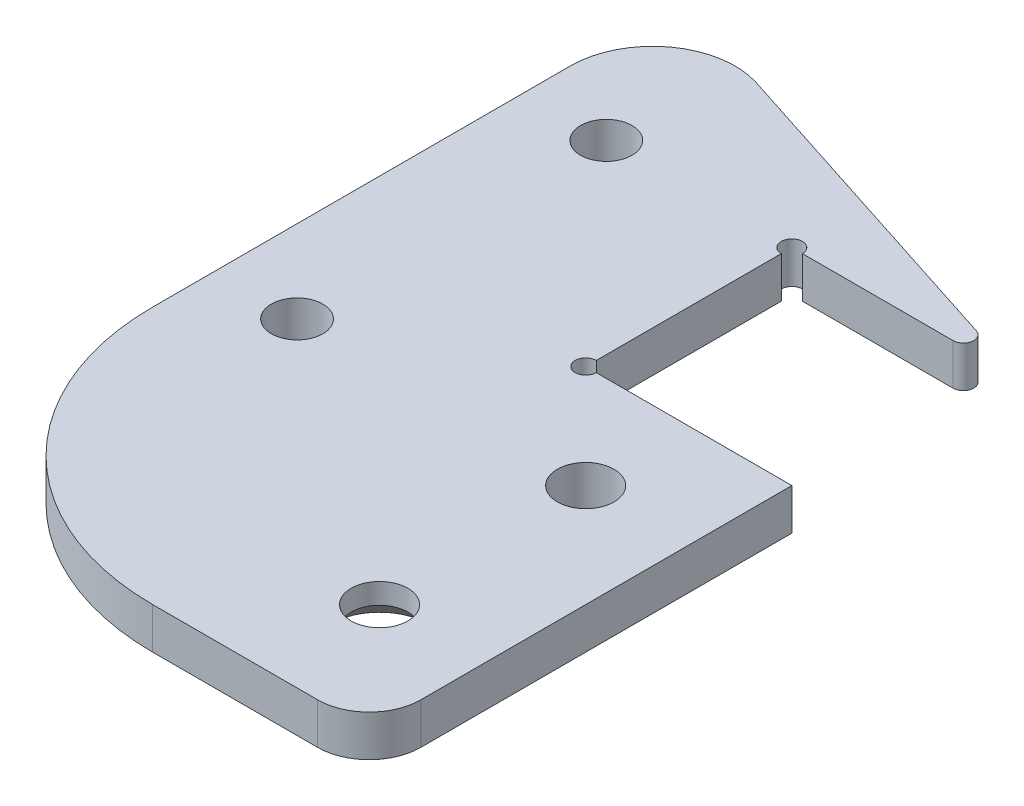
ISO-10303-21;
HEADER;
FILE_DESCRIPTION(('STEP AP214'),'2;1');
FILE_NAME('part.step','',(''),(''),'','','');
FILE_SCHEMA(('AUTOMOTIVE_DESIGN { 1 0 10303 214 1 1 1 1 }'));
ENDSEC;
DATA;
#1=APPLICATION_CONTEXT('core data for automotive mechanical design processes');
#2=APPLICATION_PROTOCOL_DEFINITION('international standard','automotive_design',2000,#1);
#3=PRODUCT_CONTEXT('',#1,'mechanical');
#4=PRODUCT('Part','Part','',(#3));
#5=PRODUCT_RELATED_PRODUCT_CATEGORY('part','',(#4));
#6=PRODUCT_DEFINITION_FORMATION('','',#4);
#7=PRODUCT_DEFINITION_CONTEXT('part definition',#1,'design');
#8=PRODUCT_DEFINITION('design','',#6,#7);
#9=PRODUCT_DEFINITION_SHAPE('','',#8);
#10=(LENGTH_UNIT() NAMED_UNIT(*) SI_UNIT(.MILLI.,.METRE.));
#11=(NAMED_UNIT(*) PLANE_ANGLE_UNIT() SI_UNIT($,.RADIAN.));
#12=(NAMED_UNIT(*) SI_UNIT($,.STERADIAN.) SOLID_ANGLE_UNIT());
#13=UNCERTAINTY_MEASURE_WITH_UNIT(LENGTH_MEASURE(1.E-05),#10,'distance_accuracy_value','');
#14=(GEOMETRIC_REPRESENTATION_CONTEXT(3) GLOBAL_UNCERTAINTY_ASSIGNED_CONTEXT((#13)) GLOBAL_UNIT_ASSIGNED_CONTEXT((#10,
#11,#12)) REPRESENTATION_CONTEXT('',''));
#15=CARTESIAN_POINT('',(0.,0.,0.));
#16=DIRECTION('',(0.,0.,1.));
#17=DIRECTION('',(1.,0.,0.));
#18=AXIS2_PLACEMENT_3D('',#15,#16,#17);
#19=CARTESIAN_POINT('',(33.,4.,31.5));
#20=DIRECTION('',(0.,-1.,0.));
#21=DIRECTION('',(0.,0.,1.));
#22=AXIS2_PLACEMENT_3D('',#19,#20,#21);
#23=PLANE('',#22);
#24=DIRECTION('',(0.,0.,1.));
#25=VECTOR('',#24,1.);
#26=CARTESIAN_POINT('',(18.,4.,-4.5));
#27=LINE('',#26,#25);
#28=CARTESIAN_POINT('',(18.,4.,-23.475));
#29=VERTEX_POINT('',#28);
#30=CARTESIAN_POINT('',(18.,4.,-5.525));
#31=VERTEX_POINT('',#30);
#32=EDGE_CURVE('E152',#29,#31,#27,.T.);
#33=ORIENTED_EDGE('',*,*,#32,.F.);
#34=CARTESIAN_POINT('',(18.,4.,-24.5));
#35=DIRECTION('',(0.,1.,0.));
#36=DIRECTION('',(0.,0.,1.));
#37=AXIS2_PLACEMENT_3D('',#34,#35,#36);
#38=CIRCLE('',#37,1.025);
#39=CARTESIAN_POINT('',(19.025,4.,-24.5));
#40=VERTEX_POINT('',#39);
#41=EDGE_CURVE('E272',#40,#29,#38,.T.);
#42=ORIENTED_EDGE('',*,*,#41,.F.);
#43=DIRECTION('',(-1.,0.,0.));
#44=VECTOR('',#43,1.);
#45=CARTESIAN_POINT('',(18.,4.,-24.5));
#46=LINE('',#45,#44);
#47=CARTESIAN_POINT('',(33.6440532323881,4.,-24.5));
#48=VERTEX_POINT('',#47);
#49=EDGE_CURVE('E156',#48,#40,#46,.T.);
#50=ORIENTED_EDGE('',*,*,#49,.F.);
#51=CARTESIAN_POINT('',(33.6440532323881,4.,-25.5));
#52=DIRECTION('',(0.,-1.,0.));
#53=DIRECTION('',(0.,0.,1.));
#54=AXIS2_PLACEMENT_3D('',#51,#52,#53);
#55=CIRCLE('',#54,1.);
#56=CARTESIAN_POINT('',(33.9511181950039,4.,-26.4516885565845));
#57=VERTEX_POINT('',#56);
#58=EDGE_CURVE('E262',#57,#48,#55,.T.);
#59=ORIENTED_EDGE('',*,*,#58,.F.);
#60=DIRECTION('',(0.951688556584447,0.,0.30706496261575));
#61=VECTOR('',#60,1.);
#62=CARTESIAN_POINT('',(33.9511181950039,4.,-26.4516885565845));
#63=LINE('',#62,#61);
#64=CARTESIAN_POINT('',(2.456519700926,4.,-36.6135084526756));
#65=VERTEX_POINT('',#64);
#66=EDGE_CURVE('E259',#65,#57,#63,.T.);
#67=ORIENTED_EDGE('',*,*,#66,.F.);
#68=CARTESIAN_POINT('',(0.,4.,-29.));
#69=DIRECTION('',(0.,-1.,0.));
#70=DIRECTION('',(0.,0.,-1.));
#71=AXIS2_PLACEMENT_3D('',#68,#69,#70);
#72=CIRCLE('',#71,8.);
#73=CARTESIAN_POINT('',(-8.,4.,-29.));
#74=VERTEX_POINT('',#73);
#75=EDGE_CURVE('E256',#74,#65,#72,.T.);
#76=ORIENTED_EDGE('',*,*,#75,.F.);
#77=DIRECTION('',(0.,0.,-1.));
#78=VECTOR('',#77,1.);
#79=CARTESIAN_POINT('',(-8.,4.,11.5));
#80=LINE('',#79,#78);
#81=CARTESIAN_POINT('',(-8.,4.,11.5));
#82=VERTEX_POINT('',#81);
#83=EDGE_CURVE('E253',#82,#74,#80,.T.);
#84=ORIENTED_EDGE('',*,*,#83,.F.);
#85=CARTESIAN_POINT('',(17.,4.,11.5));
#86=DIRECTION('',(0.,-1.,0.));
#87=DIRECTION('',(0.,0.,-1.));
#88=AXIS2_PLACEMENT_3D('',#85,#86,#87);
#89=CIRCLE('',#88,25.);
#90=CARTESIAN_POINT('',(17.,4.,36.5));
#91=VERTEX_POINT('',#90);
#92=EDGE_CURVE('E250',#91,#82,#89,.T.);
#93=ORIENTED_EDGE('',*,*,#92,.F.);
#94=DIRECTION('',(-1.,0.,0.));
#95=VECTOR('',#94,1.);
#96=CARTESIAN_POINT('',(33.,4.,36.5));
#97=LINE('',#96,#95);
#98=CARTESIAN_POINT('',(33.,4.,36.5));
#99=VERTEX_POINT('',#98);
#100=EDGE_CURVE('E247',#99,#91,#97,.T.);
#101=ORIENTED_EDGE('',*,*,#100,.F.);
#102=CARTESIAN_POINT('',(33.,4.,31.5));
#103=DIRECTION('',(0.,-1.,0.));
#104=DIRECTION('',(0.,0.,1.));
#105=AXIS2_PLACEMENT_3D('',#102,#103,#104);
#106=CIRCLE('',#105,5.);
#107=CARTESIAN_POINT('',(38.,4.,31.5));
#108=VERTEX_POINT('',#107);
#109=EDGE_CURVE('E244',#108,#99,#106,.T.);
#110=ORIENTED_EDGE('',*,*,#109,.F.);
#111=DIRECTION('',(0.,0.,1.));
#112=VECTOR('',#111,1.);
#113=CARTESIAN_POINT('',(38.,4.,-4.5));
#114=LINE('',#113,#112);
#115=CARTESIAN_POINT('',(38.,4.,-4.5));
#116=VERTEX_POINT('',#115);
#117=EDGE_CURVE('E150',#116,#108,#114,.T.);
#118=ORIENTED_EDGE('',*,*,#117,.F.);
#119=DIRECTION('',(1.,0.,0.));
#120=VECTOR('',#119,1.);
#121=CARTESIAN_POINT('',(38.,4.,-4.5));
#122=LINE('',#121,#120);
#123=CARTESIAN_POINT('',(19.025,4.,-4.5));
#124=VERTEX_POINT('',#123);
#125=EDGE_CURVE('E132',#124,#116,#122,.T.);
#126=ORIENTED_EDGE('',*,*,#125,.F.);
#127=CARTESIAN_POINT('',(18.,4.,-4.5));
#128=DIRECTION('',(0.,1.,0.));
#129=DIRECTION('',(0.,0.,1.));
#130=AXIS2_PLACEMENT_3D('',#127,#128,#129);
#131=CIRCLE('',#130,1.025);
#132=EDGE_CURVE('E139',#31,#124,#131,.T.);
#133=ORIENTED_EDGE('',*,*,#132,.F.);
#134=EDGE_LOOP('',(#33,#42,#50,#59,#67,#76,#84,#93,#101,#110,#118,#126,#133));
#135=FACE_BOUND('',#134,.T.);
#136=CARTESIAN_POINT('',(5.88426073792755E-12,4.,5.49999999982597));
#137=DIRECTION('',(0.,-1.,0.));
#138=DIRECTION('',(0.,0.,-1.));
#139=AXIS2_PLACEMENT_3D('',#136,#137,#138);
#140=CIRCLE('',#139,2.5);
#141=CARTESIAN_POINT('',(5.88426073792755E-12,4.,2.99999999982597));
#142=VERTEX_POINT('',#141);
#143=EDGE_CURVE('E164',#142,#142,#140,.T.);
#144=ORIENTED_EDGE('',*,*,#143,.T.);
#145=EDGE_LOOP('',(#144));
#146=FACE_BOUND('',#145,.T.);
#147=CARTESIAN_POINT('',(28.0000000000034,4.,5.49999999999137));
#148=DIRECTION('',(0.,-1.,0.));
#149=DIRECTION('',(0.,0.,-1.));
#150=AXIS2_PLACEMENT_3D('',#147,#148,#149);
#151=CIRCLE('',#150,2.74999999999999);
#152=CARTESIAN_POINT('',(28.0000000000034,4.,2.74999999999137));
#153=VERTEX_POINT('',#152);
#154=EDGE_CURVE('E229',#153,#153,#151,.T.);
#155=ORIENTED_EDGE('',*,*,#154,.T.);
#156=EDGE_LOOP('',(#155));
#157=FACE_BOUND('',#156,.T.);
#158=CARTESIAN_POINT('',(28.0000000000037,4.,25.4999999999914));
#159=DIRECTION('',(0.,-1.,0.));
#160=DIRECTION('',(0.,0.,-1.));
#161=AXIS2_PLACEMENT_3D('',#158,#159,#160);
#162=CIRCLE('',#161,2.75);
#163=CARTESIAN_POINT('',(28.0000000000037,4.,22.7499999999914));
#164=VERTEX_POINT('',#163);
#165=EDGE_CURVE('E223',#164,#164,#162,.T.);
#166=ORIENTED_EDGE('',*,*,#165,.T.);
#167=EDGE_LOOP('',(#166));
#168=FACE_BOUND('',#167,.T.);
#169=CARTESIAN_POINT('',(2.88657986402541E-12,4.,-24.5000000001652));
#170=DIRECTION('',(0.,-1.,0.));
#171=DIRECTION('',(0.,0.,-1.));
#172=AXIS2_PLACEMENT_3D('',#169,#170,#171);
#173=CIRCLE('',#172,2.5);
#174=CARTESIAN_POINT('',(2.88657986402541E-12,4.,-27.0000000001652));
#175=VERTEX_POINT('',#174);
#176=EDGE_CURVE('E226',#175,#175,#173,.T.);
#177=ORIENTED_EDGE('',*,*,#176,.T.);
#178=EDGE_LOOP('',(#177));
#179=FACE_BOUND('',#178,.T.);
#180=ADVANCED_FACE('F37',(#135,#146,#157,#168,#179),#23,.F.);
#181=CARTESIAN_POINT('',(33.,0.,31.5));
#182=DIRECTION('',(0.,-1.,0.));
#183=DIRECTION('',(0.,0.,1.));
#184=AXIS2_PLACEMENT_3D('',#181,#182,#183);
#185=PLANE('',#184);
#186=CARTESIAN_POINT('',(18.,0.,-4.5));
#187=DIRECTION('',(0.,1.,0.));
#188=DIRECTION('',(0.,0.,1.));
#189=AXIS2_PLACEMENT_3D('',#186,#187,#188);
#190=CIRCLE('',#189,1.025);
#191=CARTESIAN_POINT('',(18.,0.,-5.525));
#192=VERTEX_POINT('',#191);
#193=CARTESIAN_POINT('',(19.025,0.,-4.5));
#194=VERTEX_POINT('',#193);
#195=EDGE_CURVE('E145',#192,#194,#190,.T.);
#196=ORIENTED_EDGE('',*,*,#195,.T.);
#197=DIRECTION('',(1.,0.,0.));
#198=VECTOR('',#197,1.);
#199=CARTESIAN_POINT('',(38.,0.,-4.5));
#200=LINE('',#199,#198);
#201=CARTESIAN_POINT('',(38.,0.,-4.5));
#202=VERTEX_POINT('',#201);
#203=EDGE_CURVE('E135',#194,#202,#200,.T.);
#204=ORIENTED_EDGE('',*,*,#203,.T.);
#205=DIRECTION('',(0.,0.,1.));
#206=VECTOR('',#205,1.);
#207=CARTESIAN_POINT('',(38.,0.,-4.5));
#208=LINE('',#207,#206);
#209=CARTESIAN_POINT('',(38.,0.,31.5));
#210=VERTEX_POINT('',#209);
#211=EDGE_CURVE('E160',#202,#210,#208,.T.);
#212=ORIENTED_EDGE('',*,*,#211,.T.);
#213=CARTESIAN_POINT('',(33.,0.,31.5));
#214=DIRECTION('',(0.,-1.,0.));
#215=DIRECTION('',(0.,0.,1.));
#216=AXIS2_PLACEMENT_3D('',#213,#214,#215);
#217=CIRCLE('',#216,5.);
#218=CARTESIAN_POINT('',(33.,0.,36.5));
#219=VERTEX_POINT('',#218);
#220=EDGE_CURVE('E163',#210,#219,#217,.T.);
#221=ORIENTED_EDGE('',*,*,#220,.T.);
#222=DIRECTION('',(-1.,0.,0.));
#223=VECTOR('',#222,1.);
#224=CARTESIAN_POINT('',(33.,0.,36.5));
#225=LINE('',#224,#223);
#226=CARTESIAN_POINT('',(17.,0.,36.5));
#227=VERTEX_POINT('',#226);
#228=EDGE_CURVE('E167',#219,#227,#225,.T.);
#229=ORIENTED_EDGE('',*,*,#228,.T.);
#230=CARTESIAN_POINT('',(17.,0.,11.5));
#231=DIRECTION('',(0.,-1.,0.));
#232=DIRECTION('',(0.,0.,-1.));
#233=AXIS2_PLACEMENT_3D('',#230,#231,#232);
#234=CIRCLE('',#233,25.);
#235=CARTESIAN_POINT('',(-8.,0.,11.5));
#236=VERTEX_POINT('',#235);
#237=EDGE_CURVE('E170',#227,#236,#234,.T.);
#238=ORIENTED_EDGE('',*,*,#237,.T.);
#239=DIRECTION('',(0.,0.,-1.));
#240=VECTOR('',#239,1.);
#241=CARTESIAN_POINT('',(-8.,0.,11.5));
#242=LINE('',#241,#240);
#243=CARTESIAN_POINT('',(-8.,0.,-29.));
#244=VERTEX_POINT('',#243);
#245=EDGE_CURVE('E173',#236,#244,#242,.T.);
#246=ORIENTED_EDGE('',*,*,#245,.T.);
#247=CARTESIAN_POINT('',(0.,0.,-29.));
#248=DIRECTION('',(0.,-1.,0.));
#249=DIRECTION('',(0.,0.,-1.));
#250=AXIS2_PLACEMENT_3D('',#247,#248,#249);
#251=CIRCLE('',#250,8.);
#252=CARTESIAN_POINT('',(2.456519700926,0.,-36.6135084526756));
#253=VERTEX_POINT('',#252);
#254=EDGE_CURVE('E176',#244,#253,#251,.T.);
#255=ORIENTED_EDGE('',*,*,#254,.T.);
#256=DIRECTION('',(0.951688556584447,0.,0.30706496261575));
#257=VECTOR('',#256,1.);
#258=CARTESIAN_POINT('',(33.9511181950039,0.,-26.4516885565845));
#259=LINE('',#258,#257);
#260=CARTESIAN_POINT('',(33.9511181950039,0.,-26.4516885565845));
#261=VERTEX_POINT('',#260);
#262=EDGE_CURVE('E179',#253,#261,#259,.T.);
#263=ORIENTED_EDGE('',*,*,#262,.T.);
#264=CARTESIAN_POINT('',(33.6440532323881,0.,-25.5));
#265=DIRECTION('',(0.,-1.,0.));
#266=DIRECTION('',(0.,0.,1.));
#267=AXIS2_PLACEMENT_3D('',#264,#265,#266);
#268=CIRCLE('',#267,1.);
#269=CARTESIAN_POINT('',(33.6440532323881,0.,-24.5));
#270=VERTEX_POINT('',#269);
#271=EDGE_CURVE('E182',#261,#270,#268,.T.);
#272=ORIENTED_EDGE('',*,*,#271,.T.);
#273=DIRECTION('',(-1.,0.,0.));
#274=VECTOR('',#273,1.);
#275=CARTESIAN_POINT('',(18.,0.,-24.5));
#276=LINE('',#275,#274);
#277=CARTESIAN_POINT('',(19.025,0.,-24.5));
#278=VERTEX_POINT('',#277);
#279=EDGE_CURVE('E185',#270,#278,#276,.T.);
#280=ORIENTED_EDGE('',*,*,#279,.T.);
#281=CARTESIAN_POINT('',(18.,0.,-24.5));
#282=DIRECTION('',(0.,1.,0.));
#283=DIRECTION('',(0.,0.,1.));
#284=AXIS2_PLACEMENT_3D('',#281,#282,#283);
#285=CIRCLE('',#284,1.025);
#286=CARTESIAN_POINT('',(18.,0.,-23.475));
#287=VERTEX_POINT('',#286);
#288=EDGE_CURVE('E273',#278,#287,#285,.T.);
#289=ORIENTED_EDGE('',*,*,#288,.T.);
#290=DIRECTION('',(0.,0.,1.));
#291=VECTOR('',#290,1.);
#292=CARTESIAN_POINT('',(18.,0.,-4.5));
#293=LINE('',#292,#291);
#294=EDGE_CURVE('E188',#287,#192,#293,.T.);
#295=ORIENTED_EDGE('',*,*,#294,.T.);
#296=EDGE_LOOP('',(#196,#204,#212,#221,#229,#238,#246,#255,#263,#272,#280,#289,#295));
#297=FACE_BOUND('',#296,.T.);
#298=CARTESIAN_POINT('',(28.0000000000037,0.,25.4999999999914));
#299=DIRECTION('',(0.,1.,0.));
#300=DIRECTION('',(0.,0.,1.));
#301=AXIS2_PLACEMENT_3D('',#298,#299,#300);
#302=CIRCLE('',#301,4.74999999999998);
#303=CARTESIAN_POINT('',(28.0000000000037,0.,30.2499999999913));
#304=VERTEX_POINT('',#303);
#305=EDGE_CURVE('E207',#304,#304,#302,.F.);
#306=ORIENTED_EDGE('',*,*,#305,.F.);
#307=EDGE_LOOP('',(#306));
#308=FACE_BOUND('',#307,.T.);
#309=CARTESIAN_POINT('',(5.88426073792755E-12,0.,5.49999999982597));
#310=DIRECTION('',(0.,-1.,0.));
#311=DIRECTION('',(0.,0.,-1.));
#312=AXIS2_PLACEMENT_3D('',#309,#310,#311);
#313=CIRCLE('',#312,2.5);
#314=CARTESIAN_POINT('',(5.88426073792755E-12,0.,2.99999999982597));
#315=VERTEX_POINT('',#314);
#316=EDGE_CURVE('E237',#315,#315,#313,.T.);
#317=ORIENTED_EDGE('',*,*,#316,.F.);
#318=EDGE_LOOP('',(#317));
#319=FACE_BOUND('',#318,.T.);
#320=CARTESIAN_POINT('',(28.0000000000034,0.,5.49999999999137));
#321=DIRECTION('',(0.,-1.,0.));
#322=DIRECTION('',(0.,0.,-1.));
#323=AXIS2_PLACEMENT_3D('',#320,#321,#322);
#324=CIRCLE('',#323,2.74999999999999);
#325=CARTESIAN_POINT('',(28.0000000000034,0.,2.74999999999137));
#326=VERTEX_POINT('',#325);
#327=EDGE_CURVE('E225',#326,#326,#324,.T.);
#328=ORIENTED_EDGE('',*,*,#327,.F.);
#329=EDGE_LOOP('',(#328));
#330=FACE_BOUND('',#329,.T.);
#331=CARTESIAN_POINT('',(2.88657986402541E-12,0.,-24.5000000001652));
#332=DIRECTION('',(0.,-1.,0.));
#333=DIRECTION('',(0.,0.,-1.));
#334=AXIS2_PLACEMENT_3D('',#331,#332,#333);
#335=CIRCLE('',#334,2.5);
#336=CARTESIAN_POINT('',(2.88657986402541E-12,0.,-27.0000000001652));
#337=VERTEX_POINT('',#336);
#338=EDGE_CURVE('E232',#337,#337,#335,.T.);
#339=ORIENTED_EDGE('',*,*,#338,.F.);
#340=EDGE_LOOP('',(#339));
#341=FACE_BOUND('',#340,.T.);
#342=ADVANCED_FACE('F281',(#297,#308,#319,#330,#341),#185,.T.);
#343=CARTESIAN_POINT('',(38.,4.,-4.5));
#344=DIRECTION('',(-1.,0.,0.));
#345=DIRECTION('',(0.,0.,-1.));
#346=AXIS2_PLACEMENT_3D('',#343,#344,#345);
#347=PLANE('',#346);
#348=ORIENTED_EDGE('',*,*,#211,.F.);
#349=DIRECTION('',(0.,-1.,0.));
#350=VECTOR('',#349,1.);
#351=CARTESIAN_POINT('',(38.,4.,-4.5));
#352=LINE('',#351,#350);
#353=EDGE_CURVE('E151',#116,#202,#352,.T.);
#354=ORIENTED_EDGE('',*,*,#353,.F.);
#355=ORIENTED_EDGE('',*,*,#117,.T.);
#356=DIRECTION('',(0.,-1.,0.));
#357=VECTOR('',#356,1.);
#358=CARTESIAN_POINT('',(38.,4.,31.5));
#359=LINE('',#358,#357);
#360=EDGE_CURVE('E205',#108,#210,#359,.T.);
#361=ORIENTED_EDGE('',*,*,#360,.T.);
#362=EDGE_LOOP('',(#348,#354,#355,#361));
#363=FACE_BOUND('',#362,.T.);
#364=ADVANCED_FACE('F300',(#363),#347,.F.);
#365=CARTESIAN_POINT('',(33.,4.,31.5));
#366=DIRECTION('',(0.,-1.,0.));
#367=DIRECTION('',(0.,0.,1.));
#368=AXIS2_PLACEMENT_3D('',#365,#366,#367);
#369=CYLINDRICAL_SURFACE('',#368,5.);
#370=ORIENTED_EDGE('',*,*,#220,.F.);
#371=ORIENTED_EDGE('',*,*,#360,.F.);
#372=ORIENTED_EDGE('',*,*,#109,.T.);
#373=DIRECTION('',(0.,-1.,0.));
#374=VECTOR('',#373,1.);
#375=CARTESIAN_POINT('',(33.,4.,36.5));
#376=LINE('',#375,#374);
#377=EDGE_CURVE('E203',#99,#219,#376,.T.);
#378=ORIENTED_EDGE('',*,*,#377,.T.);
#379=EDGE_LOOP('',(#370,#371,#372,#378));
#380=FACE_BOUND('',#379,.T.);
#381=ADVANCED_FACE('F426',(#380),#369,.T.);
#382=CARTESIAN_POINT('',(33.,4.,36.5));
#383=DIRECTION('',(0.,0.,-1.));
#384=DIRECTION('',(1.,0.,0.));
#385=AXIS2_PLACEMENT_3D('',#382,#383,#384);
#386=PLANE('',#385);
#387=ORIENTED_EDGE('',*,*,#228,.F.);
#388=ORIENTED_EDGE('',*,*,#377,.F.);
#389=ORIENTED_EDGE('',*,*,#100,.T.);
#390=DIRECTION('',(0.,-1.,0.));
#391=VECTOR('',#390,1.);
#392=CARTESIAN_POINT('',(17.,4.,36.5));
#393=LINE('',#392,#391);
#394=EDGE_CURVE('E201',#91,#227,#393,.T.);
#395=ORIENTED_EDGE('',*,*,#394,.T.);
#396=EDGE_LOOP('',(#387,#388,#389,#395));
#397=FACE_BOUND('',#396,.T.);
#398=ADVANCED_FACE('F416',(#397),#386,.F.);
#399=CARTESIAN_POINT('',(17.,4.,11.5));
#400=DIRECTION('',(0.,-1.,0.));
#401=DIRECTION('',(0.,0.,1.));
#402=AXIS2_PLACEMENT_3D('',#399,#400,#401);
#403=CYLINDRICAL_SURFACE('',#402,25.);
#404=ORIENTED_EDGE('',*,*,#237,.F.);
#405=ORIENTED_EDGE('',*,*,#394,.F.);
#406=ORIENTED_EDGE('',*,*,#92,.T.);
#407=DIRECTION('',(0.,-1.,0.));
#408=VECTOR('',#407,1.);
#409=CARTESIAN_POINT('',(-8.,4.,11.5));
#410=LINE('',#409,#408);
#411=EDGE_CURVE('E199',#82,#236,#410,.T.);
#412=ORIENTED_EDGE('',*,*,#411,.T.);
#413=EDGE_LOOP('',(#404,#405,#406,#412));
#414=FACE_BOUND('',#413,.T.);
#415=ADVANCED_FACE('F406',(#414),#403,.T.);
#416=CARTESIAN_POINT('',(-8.,4.,11.5));
#417=DIRECTION('',(1.,0.,0.));
#418=DIRECTION('',(0.,0.,1.));
#419=AXIS2_PLACEMENT_3D('',#416,#417,#418);
#420=PLANE('',#419);
#421=ORIENTED_EDGE('',*,*,#245,.F.);
#422=ORIENTED_EDGE('',*,*,#411,.F.);
#423=ORIENTED_EDGE('',*,*,#83,.T.);
#424=DIRECTION('',(0.,-1.,0.));
#425=VECTOR('',#424,1.);
#426=CARTESIAN_POINT('',(-8.,4.,-29.));
#427=LINE('',#426,#425);
#428=EDGE_CURVE('E197',#74,#244,#427,.T.);
#429=ORIENTED_EDGE('',*,*,#428,.T.);
#430=EDGE_LOOP('',(#421,#422,#423,#429));
#431=FACE_BOUND('',#430,.T.);
#432=ADVANCED_FACE('F396',(#431),#420,.F.);
#433=CARTESIAN_POINT('',(0.,4.,-29.));
#434=DIRECTION('',(0.,-1.,0.));
#435=DIRECTION('',(0.,0.,1.));
#436=AXIS2_PLACEMENT_3D('',#433,#434,#435);
#437=CYLINDRICAL_SURFACE('',#436,8.);
#438=ORIENTED_EDGE('',*,*,#254,.F.);
#439=ORIENTED_EDGE('',*,*,#428,.F.);
#440=ORIENTED_EDGE('',*,*,#75,.T.);
#441=DIRECTION('',(0.,-1.,0.));
#442=VECTOR('',#441,1.);
#443=CARTESIAN_POINT('',(2.456519700926,4.,-36.6135084526756));
#444=LINE('',#443,#442);
#445=EDGE_CURVE('E195',#65,#253,#444,.T.);
#446=ORIENTED_EDGE('',*,*,#445,.T.);
#447=EDGE_LOOP('',(#438,#439,#440,#446));
#448=FACE_BOUND('',#447,.T.);
#449=ADVANCED_FACE('F386',(#448),#437,.T.);
#450=CARTESIAN_POINT('',(33.9511181950039,4.,-26.4516885565845));
#451=DIRECTION('',(-0.30706496261575,0.,0.951688556584447));
#452=DIRECTION('',(-0.951688556584447,0.,-0.30706496261575));
#453=AXIS2_PLACEMENT_3D('',#450,#451,#452);
#454=PLANE('',#453);
#455=ORIENTED_EDGE('',*,*,#262,.F.);
#456=ORIENTED_EDGE('',*,*,#445,.F.);
#457=ORIENTED_EDGE('',*,*,#66,.T.);
#458=DIRECTION('',(0.,-1.,0.));
#459=VECTOR('',#458,1.);
#460=CARTESIAN_POINT('',(33.9511181950039,4.,-26.4516885565845));
#461=LINE('',#460,#459);
#462=EDGE_CURVE('E193',#57,#261,#461,.T.);
#463=ORIENTED_EDGE('',*,*,#462,.T.);
#464=EDGE_LOOP('',(#455,#456,#457,#463));
#465=FACE_BOUND('',#464,.T.);
#466=ADVANCED_FACE('F376',(#465),#454,.F.);
#467=CARTESIAN_POINT('',(33.6440532323881,4.,-25.5));
#468=DIRECTION('',(0.,-1.,0.));
#469=DIRECTION('',(0.,0.,1.));
#470=AXIS2_PLACEMENT_3D('',#467,#468,#469);
#471=CYLINDRICAL_SURFACE('',#470,1.);
#472=ORIENTED_EDGE('',*,*,#271,.F.);
#473=ORIENTED_EDGE('',*,*,#462,.F.);
#474=ORIENTED_EDGE('',*,*,#58,.T.);
#475=DIRECTION('',(0.,-1.,0.));
#476=VECTOR('',#475,1.);
#477=CARTESIAN_POINT('',(33.6440532323881,4.,-24.5));
#478=LINE('',#477,#476);
#479=EDGE_CURVE('E154',#48,#270,#478,.T.);
#480=ORIENTED_EDGE('',*,*,#479,.T.);
#481=EDGE_LOOP('',(#472,#473,#474,#480));
#482=FACE_BOUND('',#481,.T.);
#483=ADVANCED_FACE('F293',(#482),#471,.T.);
#484=CARTESIAN_POINT('',(18.,4.,-24.5));
#485=DIRECTION('',(0.,0.,-1.));
#486=DIRECTION('',(1.,0.,0.));
#487=AXIS2_PLACEMENT_3D('',#484,#485,#486);
#488=PLANE('',#487);
#489=ORIENTED_EDGE('',*,*,#279,.F.);
#490=ORIENTED_EDGE('',*,*,#479,.F.);
#491=ORIENTED_EDGE('',*,*,#49,.T.);
#492=DIRECTION('',(0.,1.,0.));
#493=VECTOR('',#492,1.);
#494=CARTESIAN_POINT('',(19.025,-0.999999999999999,-24.5));
#495=LINE('',#494,#493);
#496=EDGE_CURVE('E270',#278,#40,#495,.T.);
#497=ORIENTED_EDGE('',*,*,#496,.F.);
#498=EDGE_LOOP('',(#489,#490,#491,#497));
#499=FACE_BOUND('',#498,.T.);
#500=ADVANCED_FACE('F269',(#499),#488,.F.);
#501=CARTESIAN_POINT('',(18.,4.,-4.5));
#502=DIRECTION('',(-1.,0.,0.));
#503=DIRECTION('',(0.,0.,-1.));
#504=AXIS2_PLACEMENT_3D('',#501,#502,#503);
#505=PLANE('',#504);
#506=ORIENTED_EDGE('',*,*,#294,.F.);
#507=DIRECTION('',(0.,1.,0.));
#508=VECTOR('',#507,1.);
#509=CARTESIAN_POINT('',(18.,-0.999999999999999,-23.475));
#510=LINE('',#509,#508);
#511=EDGE_CURVE('E11',#29,#287,#510,.F.);
#512=ORIENTED_EDGE('',*,*,#511,.F.);
#513=ORIENTED_EDGE('',*,*,#32,.T.);
#514=DIRECTION('',(0.,1.,0.));
#515=VECTOR('',#514,1.);
#516=CARTESIAN_POINT('',(18.,-0.999999999999999,-5.525));
#517=LINE('',#516,#515);
#518=EDGE_CURVE('E141',#192,#31,#517,.T.);
#519=ORIENTED_EDGE('',*,*,#518,.F.);
#520=EDGE_LOOP('',(#506,#512,#513,#519));
#521=FACE_BOUND('',#520,.T.);
#522=ADVANCED_FACE('F284',(#521),#505,.F.);
#523=CARTESIAN_POINT('',(38.,4.,-4.5));
#524=DIRECTION('',(0.,0.,1.));
#525=DIRECTION('',(-1.,0.,0.));
#526=AXIS2_PLACEMENT_3D('',#523,#524,#525);
#527=PLANE('',#526);
#528=ORIENTED_EDGE('',*,*,#125,.T.);
#529=ORIENTED_EDGE('',*,*,#353,.T.);
#530=ORIENTED_EDGE('',*,*,#203,.F.);
#531=DIRECTION('',(0.,1.,0.));
#532=VECTOR('',#531,1.);
#533=CARTESIAN_POINT('',(19.025,-0.999999999999999,-4.5));
#534=LINE('',#533,#532);
#535=EDGE_CURVE('E45',#124,#194,#534,.F.);
#536=ORIENTED_EDGE('',*,*,#535,.F.);
#537=EDGE_LOOP('',(#528,#529,#530,#536));
#538=FACE_BOUND('',#537,.T.);
#539=ADVANCED_FACE('F130',(#538),#527,.F.);
#540=CARTESIAN_POINT('',(5.88426073792755E-12,4.,5.49999999982597));
#541=DIRECTION('',(0.,-1.,0.));
#542=DIRECTION('',(0.,0.,1.));
#543=AXIS2_PLACEMENT_3D('',#540,#541,#542);
#544=CYLINDRICAL_SURFACE('',#543,2.5);
#545=ORIENTED_EDGE('',*,*,#143,.F.);
#546=EDGE_LOOP('',(#545));
#547=FACE_BOUND('',#546,.T.);
#548=ORIENTED_EDGE('',*,*,#316,.T.);
#549=EDGE_LOOP('',(#548));
#550=FACE_BOUND('',#549,.T.);
#551=ADVANCED_FACE('F291',(#547,#550),#544,.F.);
#552=CARTESIAN_POINT('',(28.0000000000034,4.,5.49999999999137));
#553=DIRECTION('',(0.,-1.,0.));
#554=DIRECTION('',(0.,0.,1.));
#555=AXIS2_PLACEMENT_3D('',#552,#553,#554);
#556=CYLINDRICAL_SURFACE('',#555,2.74999999999999);
#557=ORIENTED_EDGE('',*,*,#154,.F.);
#558=EDGE_LOOP('',(#557));
#559=FACE_BOUND('',#558,.T.);
#560=ORIENTED_EDGE('',*,*,#327,.T.);
#561=EDGE_LOOP('',(#560));
#562=FACE_BOUND('',#561,.T.);
#563=ADVANCED_FACE('F219',(#559,#562),#556,.F.);
#564=CARTESIAN_POINT('',(28.0000000000037,4.,25.4999999999914));
#565=DIRECTION('',(0.,-1.,0.));
#566=DIRECTION('',(0.,0.,1.));
#567=AXIS2_PLACEMENT_3D('',#564,#565,#566);
#568=CYLINDRICAL_SURFACE('',#567,2.75);
#569=CARTESIAN_POINT('',(28.0000000000037,1.99999999999999,25.4999999999914));
#570=DIRECTION('',(0.,1.,0.));
#571=DIRECTION('',(0.,0.,1.));
#572=AXIS2_PLACEMENT_3D('',#569,#570,#571);
#573=CIRCLE('',#572,2.75);
#574=CARTESIAN_POINT('',(28.0000000000037,1.99999999999999,28.2499999999914));
#575=VERTEX_POINT('',#574);
#576=EDGE_CURVE('E137',#575,#575,#573,.T.);
#577=ORIENTED_EDGE('',*,*,#576,.F.);
#578=EDGE_LOOP('',(#577));
#579=FACE_BOUND('',#578,.T.);
#580=ORIENTED_EDGE('',*,*,#165,.F.);
#581=EDGE_LOOP('',(#580));
#582=FACE_BOUND('',#581,.T.);
#583=ADVANCED_FACE('F215',(#579,#582),#568,.F.);
#584=CARTESIAN_POINT('',(2.88657986402541E-12,4.,-24.5000000001652));
#585=DIRECTION('',(0.,-1.,0.));
#586=DIRECTION('',(0.,0.,1.));
#587=AXIS2_PLACEMENT_3D('',#584,#585,#586);
#588=CYLINDRICAL_SURFACE('',#587,2.5);
#589=ORIENTED_EDGE('',*,*,#176,.F.);
#590=EDGE_LOOP('',(#589));
#591=FACE_BOUND('',#590,.T.);
#592=ORIENTED_EDGE('',*,*,#338,.T.);
#593=EDGE_LOOP('',(#592));
#594=FACE_BOUND('',#593,.T.);
#595=ADVANCED_FACE('F218',(#591,#594),#588,.F.);
#596=CARTESIAN_POINT('',(28.0000000000037,0.,25.4999999999914));
#597=DIRECTION('',(0.,-1.,0.));
#598=DIRECTION('',(0.,0.,1.));
#599=AXIS2_PLACEMENT_3D('',#596,#597,#598);
#600=CONICAL_SURFACE('',#599,4.74999999999998,0.785398163397446);
#601=ORIENTED_EDGE('',*,*,#576,.T.);
#602=EDGE_LOOP('',(#601));
#603=FACE_BOUND('',#602,.T.);
#604=ORIENTED_EDGE('',*,*,#305,.T.);
#605=EDGE_LOOP('',(#604));
#606=FACE_BOUND('',#605,.T.);
#607=ADVANCED_FACE('F39',(#603,#606),#600,.F.);
#608=CARTESIAN_POINT('',(18.,-0.999999999999999,-4.5));
#609=DIRECTION('',(0.,1.,0.));
#610=DIRECTION('',(0.,0.,-1.));
#611=AXIS2_PLACEMENT_3D('',#608,#609,#610);
#612=CYLINDRICAL_SURFACE('',#611,1.025);
#613=ORIENTED_EDGE('',*,*,#195,.F.);
#614=ORIENTED_EDGE('',*,*,#518,.T.);
#615=ORIENTED_EDGE('',*,*,#132,.T.);
#616=ORIENTED_EDGE('',*,*,#535,.T.);
#617=EDGE_LOOP('',(#613,#614,#615,#616));
#618=FACE_BOUND('',#617,.T.);
#619=ADVANCED_FACE('F140',(#618),#612,.F.);
#620=CARTESIAN_POINT('',(18.,-0.999999999999999,-24.5));
#621=DIRECTION('',(0.,1.,0.));
#622=DIRECTION('',(0.,0.,-1.));
#623=AXIS2_PLACEMENT_3D('',#620,#621,#622);
#624=CYLINDRICAL_SURFACE('',#623,1.025);
#625=ORIENTED_EDGE('',*,*,#288,.F.);
#626=ORIENTED_EDGE('',*,*,#496,.T.);
#627=ORIENTED_EDGE('',*,*,#41,.T.);
#628=ORIENTED_EDGE('',*,*,#511,.T.);
#629=EDGE_LOOP('',(#625,#626,#627,#628));
#630=FACE_BOUND('',#629,.T.);
#631=ADVANCED_FACE('F312',(#630),#624,.F.);
#632=CLOSED_SHELL('',(#180,#342,#364,#381,#398,#415,#432,#449,#466,#483,#500,#522,#539,#551,
#563,#583,#595,#607,#619,#631));
#633=MANIFOLD_SOLID_BREP('B2',#632);
#634=ADVANCED_BREP_SHAPE_REPRESENTATION('',(#18,#633),#14);
#635=SHAPE_DEFINITION_REPRESENTATION(#9,#634);
ENDSEC;
END-ISO-10303-21;
